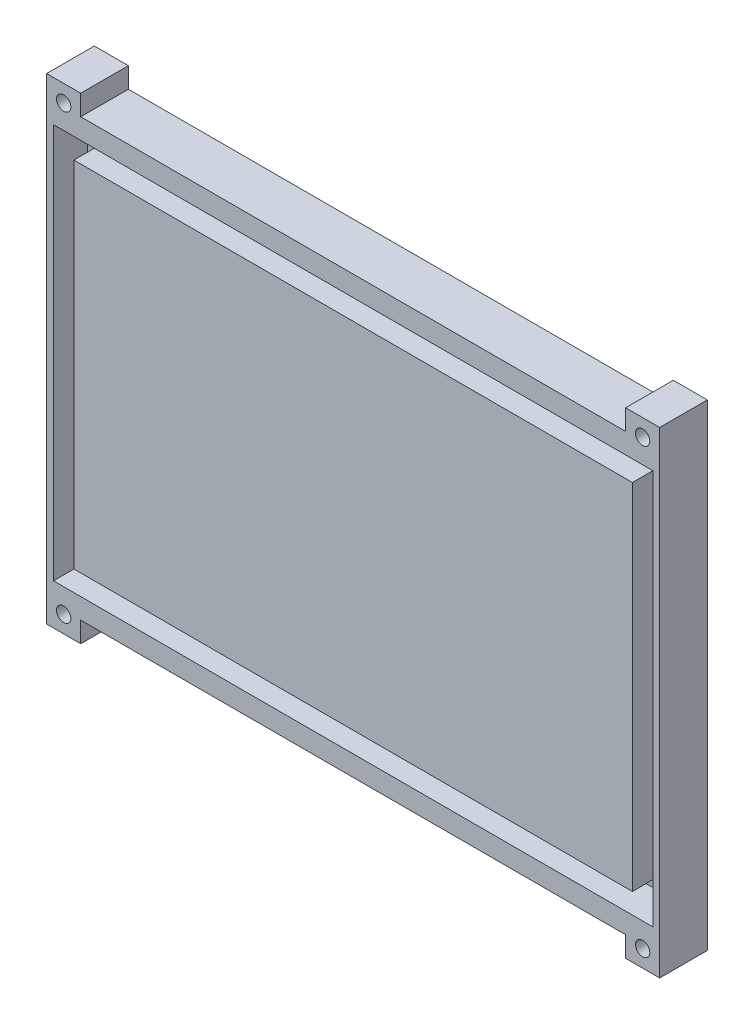
ISO-10303-21;
HEADER;
FILE_DESCRIPTION(('STEP AP214'),'2;1');
FILE_NAME('part.step','',(''),(''),'','','');
FILE_SCHEMA(('AUTOMOTIVE_DESIGN { 1 0 10303 214 1 1 1 1 }'));
ENDSEC;
DATA;
#1=APPLICATION_CONTEXT('core data for automotive mechanical design processes');
#2=APPLICATION_PROTOCOL_DEFINITION('international standard','automotive_design',2000,#1);
#3=PRODUCT_CONTEXT('',#1,'mechanical');
#4=PRODUCT('Part','Part','',(#3));
#5=PRODUCT_RELATED_PRODUCT_CATEGORY('part','',(#4));
#6=PRODUCT_DEFINITION_FORMATION('','',#4);
#7=PRODUCT_DEFINITION_CONTEXT('part definition',#1,'design');
#8=PRODUCT_DEFINITION('design','',#6,#7);
#9=PRODUCT_DEFINITION_SHAPE('','',#8);
#10=(LENGTH_UNIT() NAMED_UNIT(*) SI_UNIT(.MILLI.,.METRE.));
#11=(NAMED_UNIT(*) PLANE_ANGLE_UNIT() SI_UNIT($,.RADIAN.));
#12=(NAMED_UNIT(*) SI_UNIT($,.STERADIAN.) SOLID_ANGLE_UNIT());
#13=UNCERTAINTY_MEASURE_WITH_UNIT(LENGTH_MEASURE(1.E-05),#10,'distance_accuracy_value','');
#14=(GEOMETRIC_REPRESENTATION_CONTEXT(3) GLOBAL_UNCERTAINTY_ASSIGNED_CONTEXT((#13)) GLOBAL_UNIT_ASSIGNED_CONTEXT((#10,
#11,#12)) REPRESENTATION_CONTEXT('',''));
#15=CARTESIAN_POINT('',(0.,0.,0.));
#16=DIRECTION('',(0.,0.,1.));
#17=DIRECTION('',(1.,0.,0.));
#18=AXIS2_PLACEMENT_3D('',#15,#16,#17);
#19=CARTESIAN_POINT('',(-89.0867155495886,42.9813664596273,10.));
#20=DIRECTION('',(0.,1.,0.));
#21=DIRECTION('',(0.,0.,1.));
#22=AXIS2_PLACEMENT_3D('',#19,#20,#21);
#23=PLANE('',#22);
#24=DIRECTION('',(0.,0.,1.));
#25=VECTOR('',#24,1.);
#26=CARTESIAN_POINT('',(-79.0867155495886,42.9813664596273,0.));
#27=LINE('',#26,#25);
#28=CARTESIAN_POINT('',(-79.0867155495886,42.9813664596273,3.));
#29=VERTEX_POINT('',#28);
#30=CARTESIAN_POINT('',(-79.0867155495886,42.9813664596273,10.));
#31=VERTEX_POINT('',#30);
#32=EDGE_CURVE('E192',#29,#31,#27,.T.);
#33=ORIENTED_EDGE('',*,*,#32,.F.);
#34=DIRECTION('',(1.,0.,0.));
#35=VECTOR('',#34,1.);
#36=CARTESIAN_POINT('',(-84.0867155495887,42.9813664596273,3.));
#37=LINE('',#36,#35);
#38=CARTESIAN_POINT('',(-84.0867155495886,42.9813664596273,3.));
#39=VERTEX_POINT('',#38);
#40=EDGE_CURVE('E371',#39,#29,#37,.T.);
#41=ORIENTED_EDGE('',*,*,#40,.F.);
#42=DIRECTION('',(0.,0.,-1.));
#43=VECTOR('',#42,1.);
#44=CARTESIAN_POINT('',(-84.0867155495886,42.9813664596273,3.));
#45=LINE('',#44,#43);
#46=CARTESIAN_POINT('',(-84.0867155495886,42.9813664596273,10.));
#47=VERTEX_POINT('',#46);
#48=EDGE_CURVE('E352',#47,#39,#45,.T.);
#49=ORIENTED_EDGE('',*,*,#48,.F.);
#50=DIRECTION('',(1.,0.,0.));
#51=VECTOR('',#50,1.);
#52=CARTESIAN_POINT('',(-89.0867155495886,42.9813664596273,10.));
#53=LINE('',#52,#51);
#54=EDGE_CURVE('E382',#47,#31,#53,.T.);
#55=ORIENTED_EDGE('',*,*,#54,.T.);
#56=EDGE_LOOP('',(#33,#41,#49,#55));
#57=FACE_BOUND('',#56,.T.);
#58=ADVANCED_FACE('F40',(#57),#23,.T.);
#59=CARTESIAN_POINT('',(-89.0867155495886,-27.0186335403727,10.));
#60=DIRECTION('',(0.,1.,0.));
#61=DIRECTION('',(0.,0.,1.));
#62=AXIS2_PLACEMENT_3D('',#59,#60,#61);
#63=PLANE('',#62);
#64=DIRECTION('',(-1.,0.,0.));
#65=VECTOR('',#64,1.);
#66=CARTESIAN_POINT('',(5.91328445041138,-27.0186335403727,3.));
#67=LINE('',#66,#65);
#68=CARTESIAN_POINT('',(-79.0867155495886,-27.0186335403727,3.));
#69=VERTEX_POINT('',#68);
#70=CARTESIAN_POINT('',(-84.0867155495886,-27.0186335403727,3.00000000000001));
#71=VERTEX_POINT('',#70);
#72=EDGE_CURVE('E381',#69,#71,#67,.T.);
#73=ORIENTED_EDGE('',*,*,#72,.F.);
#74=DIRECTION('',(0.,0.,1.));
#75=VECTOR('',#74,1.);
#76=CARTESIAN_POINT('',(-79.0867155495886,-27.0186335403727,0.));
#77=LINE('',#76,#75);
#78=CARTESIAN_POINT('',(-79.0867155495886,-27.0186335403727,10.));
#79=VERTEX_POINT('',#78);
#80=EDGE_CURVE('E225',#69,#79,#77,.T.);
#81=ORIENTED_EDGE('',*,*,#80,.T.);
#82=DIRECTION('',(1.,0.,0.));
#83=VECTOR('',#82,1.);
#84=CARTESIAN_POINT('',(-89.0867155495886,-27.0186335403727,10.));
#85=LINE('',#84,#83);
#86=CARTESIAN_POINT('',(-84.0867155495886,-27.0186335403727,10.));
#87=VERTEX_POINT('',#86);
#88=EDGE_CURVE('E386',#87,#79,#85,.T.);
#89=ORIENTED_EDGE('',*,*,#88,.F.);
#90=DIRECTION('',(0.,0.,1.));
#91=VECTOR('',#90,1.);
#92=CARTESIAN_POINT('',(-84.0867155495886,-27.0186335403727,3.00000000000001));
#93=LINE('',#92,#91);
#94=EDGE_CURVE('E344',#71,#87,#93,.T.);
#95=ORIENTED_EDGE('',*,*,#94,.F.);
#96=EDGE_LOOP('',(#73,#81,#89,#95));
#97=FACE_BOUND('',#96,.T.);
#98=ADVANCED_FACE('F440',(#97),#63,.F.);
#99=DIRECTION('',(0.,0.,1.));
#100=VECTOR('',#99,1.);
#101=CARTESIAN_POINT('',(0.913284450411375,42.9813664596273,0.));
#102=LINE('',#101,#100);
#103=CARTESIAN_POINT('',(0.913284450411375,42.9813664596273,3.));
#104=VERTEX_POINT('',#103);
#105=CARTESIAN_POINT('',(0.913284450411375,42.9813664596273,10.));
#106=VERTEX_POINT('',#105);
#107=EDGE_CURVE('E209',#104,#106,#102,.T.);
#108=ORIENTED_EDGE('',*,*,#107,.T.);
#109=CARTESIAN_POINT('',(5.91328445041137,42.9813664596273,10.));
#110=VERTEX_POINT('',#109);
#111=EDGE_CURVE('E375',#106,#110,#53,.T.);
#112=ORIENTED_EDGE('',*,*,#111,.T.);
#113=DIRECTION('',(0.,0.,1.));
#114=VECTOR('',#113,1.);
#115=CARTESIAN_POINT('',(5.91328445041136,42.9813664596273,3.));
#116=LINE('',#115,#114);
#117=CARTESIAN_POINT('',(5.91328445041136,42.9813664596273,3.));
#118=VERTEX_POINT('',#117);
#119=EDGE_CURVE('E359',#118,#110,#116,.T.);
#120=ORIENTED_EDGE('',*,*,#119,.F.);
#121=EDGE_CURVE('E376',#104,#118,#37,.T.);
#122=ORIENTED_EDGE('',*,*,#121,.F.);
#123=EDGE_LOOP('',(#108,#112,#120,#122));
#124=FACE_BOUND('',#123,.T.);
#125=ADVANCED_FACE('F42',(#124),#23,.T.);
#126=CARTESIAN_POINT('',(0.91328445041132,-27.0186335403727,10.));
#127=VERTEX_POINT('',#126);
#128=CARTESIAN_POINT('',(5.91328445041137,-27.0186335403727,10.));
#129=VERTEX_POINT('',#128);
#130=EDGE_CURVE('E385',#127,#129,#85,.T.);
#131=ORIENTED_EDGE('',*,*,#130,.F.);
#132=DIRECTION('',(0.,0.,1.));
#133=VECTOR('',#132,1.);
#134=CARTESIAN_POINT('',(0.91328445041132,-27.0186335403727,0.));
#135=LINE('',#134,#133);
#136=CARTESIAN_POINT('',(0.91328445041132,-27.0186335403727,3.));
#137=VERTEX_POINT('',#136);
#138=EDGE_CURVE('E230',#137,#127,#135,.T.);
#139=ORIENTED_EDGE('',*,*,#138,.F.);
#140=CARTESIAN_POINT('',(5.91328445041136,-27.0186335403727,3.));
#141=VERTEX_POINT('',#140);
#142=EDGE_CURVE('E377',#141,#137,#67,.T.);
#143=ORIENTED_EDGE('',*,*,#142,.F.);
#144=DIRECTION('',(0.,0.,-1.));
#145=VECTOR('',#144,1.);
#146=CARTESIAN_POINT('',(5.91328445041137,-27.0186335403727,2.99999999999999));
#147=LINE('',#146,#145);
#148=EDGE_CURVE('E367',#129,#141,#147,.T.);
#149=ORIENTED_EDGE('',*,*,#148,.F.);
#150=EDGE_LOOP('',(#131,#139,#143,#149));
#151=FACE_BOUND('',#150,.T.);
#152=ADVANCED_FACE('F448',(#151),#63,.F.);
#153=CARTESIAN_POINT('',(0.,0.,10.));
#154=DIRECTION('',(0.,0.,-1.));
#155=DIRECTION('',(-1.,0.,0.));
#156=AXIS2_PLACEMENT_3D('',#153,#154,#155);
#157=PLANE('',#156);
#158=DIRECTION('',(1.,0.,0.));
#159=VECTOR('',#158,1.);
#160=CARTESIAN_POINT('',(-79.0867155495886,39.9813664596273,10.));
#161=LINE('',#160,#159);
#162=CARTESIAN_POINT('',(-79.0867155495886,39.9813664596273,10.));
#163=VERTEX_POINT('',#162);
#164=CARTESIAN_POINT('',(0.913284450411375,39.9813664596273,10.));
#165=VERTEX_POINT('',#164);
#166=EDGE_CURVE('E180',#163,#165,#161,.T.);
#167=ORIENTED_EDGE('',*,*,#166,.F.);
#168=DIRECTION('',(0.,-1.,0.));
#169=VECTOR('',#168,1.);
#170=CARTESIAN_POINT('',(-79.0867155495886,42.9813664596273,10.));
#171=LINE('',#170,#169);
#172=EDGE_CURVE('E189',#31,#163,#171,.T.);
#173=ORIENTED_EDGE('',*,*,#172,.F.);
#174=ORIENTED_EDGE('',*,*,#54,.F.);
#175=DIRECTION('',(0.,1.,0.));
#176=VECTOR('',#175,1.);
#177=CARTESIAN_POINT('',(-84.0867155495886,42.9813664596273,10.));
#178=LINE('',#177,#176);
#179=EDGE_CURVE('E348',#87,#47,#178,.T.);
#180=ORIENTED_EDGE('',*,*,#179,.F.);
#181=ORIENTED_EDGE('',*,*,#88,.T.);
#182=DIRECTION('',(0.,-1.,0.));
#183=VECTOR('',#182,1.);
#184=CARTESIAN_POINT('',(-79.0867155495886,-27.0186335403727,10.));
#185=LINE('',#184,#183);
#186=CARTESIAN_POINT('',(-79.0867155495886,-24.0186335403727,10.));
#187=VERTEX_POINT('',#186);
#188=EDGE_CURVE('E215',#187,#79,#185,.T.);
#189=ORIENTED_EDGE('',*,*,#188,.F.);
#190=DIRECTION('',(-1.,0.,0.));
#191=VECTOR('',#190,1.);
#192=CARTESIAN_POINT('',(-79.0867155495886,-24.0186335403727,10.));
#193=LINE('',#192,#191);
#194=CARTESIAN_POINT('',(0.91328445041132,-24.0186335403727,10.));
#195=VERTEX_POINT('',#194);
#196=EDGE_CURVE('E221',#195,#187,#193,.T.);
#197=ORIENTED_EDGE('',*,*,#196,.F.);
#198=DIRECTION('',(0.,1.,0.));
#199=VECTOR('',#198,1.);
#200=CARTESIAN_POINT('',(0.91328445041132,-27.0186335403727,10.));
#201=LINE('',#200,#199);
#202=EDGE_CURVE('E218',#127,#195,#201,.T.);
#203=ORIENTED_EDGE('',*,*,#202,.F.);
#204=ORIENTED_EDGE('',*,*,#130,.T.);
#205=DIRECTION('',(0.,-1.,0.));
#206=VECTOR('',#205,1.);
#207=CARTESIAN_POINT('',(5.91328445041136,42.9813664596273,10.));
#208=LINE('',#207,#206);
#209=EDGE_CURVE('E363',#110,#129,#208,.T.);
#210=ORIENTED_EDGE('',*,*,#209,.F.);
#211=ORIENTED_EDGE('',*,*,#111,.F.);
#212=DIRECTION('',(0.,1.,0.));
#213=VECTOR('',#212,1.);
#214=CARTESIAN_POINT('',(0.913284450411375,42.9813664596273,10.));
#215=LINE('',#214,#213);
#216=EDGE_CURVE('E186',#165,#106,#215,.T.);
#217=ORIENTED_EDGE('',*,*,#216,.F.);
#218=EDGE_LOOP('',(#167,#173,#174,#180,#181,#189,#197,#203,#204,#210,#211,#217));
#219=FACE_BOUND('',#218,.T.);
#220=DIRECTION('',(0.,-1.,0.));
#221=VECTOR('',#220,1.);
#222=CARTESIAN_POINT('',(-83.0867155495886,36.9813664596273,10.));
#223=LINE('',#222,#221);
#224=CARTESIAN_POINT('',(-83.0867155495886,36.9813664596273,10.));
#225=VERTEX_POINT('',#224);
#226=CARTESIAN_POINT('',(-83.0867155495886,-21.0186335403727,10.));
#227=VERTEX_POINT('',#226);
#228=EDGE_CURVE('E317',#225,#227,#223,.T.);
#229=ORIENTED_EDGE('',*,*,#228,.F.);
#230=DIRECTION('',(-1.,0.,0.));
#231=VECTOR('',#230,1.);
#232=CARTESIAN_POINT('',(-83.0867155495886,36.9813664596273,10.));
#233=LINE('',#232,#231);
#234=CARTESIAN_POINT('',(4.91328445041138,36.9813664596273,10.));
#235=VERTEX_POINT('',#234);
#236=EDGE_CURVE('E287',#235,#225,#233,.T.);
#237=ORIENTED_EDGE('',*,*,#236,.F.);
#238=DIRECTION('',(0.,1.,0.));
#239=VECTOR('',#238,1.);
#240=CARTESIAN_POINT('',(4.91328445041138,36.9813664596273,10.));
#241=LINE('',#240,#239);
#242=CARTESIAN_POINT('',(4.91328445041138,-21.0186335403727,10.));
#243=VERTEX_POINT('',#242);
#244=EDGE_CURVE('E302',#243,#235,#241,.T.);
#245=ORIENTED_EDGE('',*,*,#244,.F.);
#246=DIRECTION('',(1.,0.,0.));
#247=VECTOR('',#246,1.);
#248=CARTESIAN_POINT('',(-83.0867155495886,-21.0186335403727,10.));
#249=LINE('',#248,#247);
#250=EDGE_CURVE('E321',#227,#243,#249,.T.);
#251=ORIENTED_EDGE('',*,*,#250,.F.);
#252=EDGE_LOOP('',(#229,#237,#245,#251));
#253=FACE_BOUND('',#252,.T.);
#254=CARTESIAN_POINT('',(-81.5867155495887,40.4813664596273,10.));
#255=DIRECTION('',(0.,0.,1.));
#256=DIRECTION('',(1.,0.,0.));
#257=AXIS2_PLACEMENT_3D('',#254,#255,#256);
#258=CIRCLE('',#257,1.04999999999999);
#259=CARTESIAN_POINT('',(-80.5367155495887,40.4813664596273,10.));
#260=VERTEX_POINT('',#259);
#261=EDGE_CURVE('E247',#260,#260,#258,.T.);
#262=ORIENTED_EDGE('',*,*,#261,.F.);
#263=EDGE_LOOP('',(#262));
#264=FACE_BOUND('',#263,.T.);
#265=CARTESIAN_POINT('',(3.41328445041142,40.4813664596273,10.));
#266=DIRECTION('',(0.,0.,1.));
#267=DIRECTION('',(-1.,0.,0.));
#268=AXIS2_PLACEMENT_3D('',#265,#266,#267);
#269=CIRCLE('',#268,1.04999999999999);
#270=CARTESIAN_POINT('',(2.36328445041143,40.4813664596273,10.));
#271=VERTEX_POINT('',#270);
#272=EDGE_CURVE('E243',#271,#271,#269,.T.);
#273=ORIENTED_EDGE('',*,*,#272,.F.);
#274=EDGE_LOOP('',(#273));
#275=FACE_BOUND('',#274,.T.);
#276=CARTESIAN_POINT('',(3.41328445041142,-24.5186335403727,10.));
#277=DIRECTION('',(0.,0.,1.));
#278=DIRECTION('',(1.,0.,0.));
#279=AXIS2_PLACEMENT_3D('',#276,#277,#278);
#280=CIRCLE('',#279,1.04999999999999);
#281=CARTESIAN_POINT('',(4.46328445041141,-24.5186335403727,10.));
#282=VERTEX_POINT('',#281);
#283=EDGE_CURVE('E239',#282,#282,#280,.T.);
#284=ORIENTED_EDGE('',*,*,#283,.F.);
#285=EDGE_LOOP('',(#284));
#286=FACE_BOUND('',#285,.T.);
#287=CARTESIAN_POINT('',(-81.5867155495887,-24.5186335403727,10.));
#288=DIRECTION('',(0.,0.,1.));
#289=DIRECTION('',(-1.,0.,0.));
#290=AXIS2_PLACEMENT_3D('',#287,#288,#289);
#291=CIRCLE('',#290,1.04999999999999);
#292=CARTESIAN_POINT('',(-82.6367155495887,-24.5186335403727,10.));
#293=VERTEX_POINT('',#292);
#294=EDGE_CURVE('E208',#293,#293,#291,.T.);
#295=ORIENTED_EDGE('',*,*,#294,.F.);
#296=EDGE_LOOP('',(#295));
#297=FACE_BOUND('',#296,.T.);
#298=ADVANCED_FACE('F198',(#219,#253,#264,#275,#286,#297),#157,.F.);
#299=CARTESIAN_POINT('',(0.,0.,3.));
#300=DIRECTION('',(0.,0.,1.));
#301=DIRECTION('',(1.,0.,0.));
#302=AXIS2_PLACEMENT_3D('',#299,#300,#301);
#303=PLANE('',#302);
#304=ORIENTED_EDGE('',*,*,#40,.T.);
#305=DIRECTION('',(0.,-1.,0.));
#306=VECTOR('',#305,1.);
#307=CARTESIAN_POINT('',(-79.0867155495886,0.,3.));
#308=LINE('',#307,#306);
#309=CARTESIAN_POINT('',(-79.0867155495886,39.9813664596273,3.));
#310=VERTEX_POINT('',#309);
#311=EDGE_CURVE('E11',#29,#310,#308,.T.);
#312=ORIENTED_EDGE('',*,*,#311,.T.);
#313=DIRECTION('',(1.,0.,0.));
#314=VECTOR('',#313,1.);
#315=CARTESIAN_POINT('',(0.,39.9813664596273,3.));
#316=LINE('',#315,#314);
#317=CARTESIAN_POINT('',(0.913284450411375,39.9813664596273,3.));
#318=VERTEX_POINT('',#317);
#319=EDGE_CURVE('E183',#310,#318,#316,.T.);
#320=ORIENTED_EDGE('',*,*,#319,.T.);
#321=DIRECTION('',(0.,1.,0.));
#322=VECTOR('',#321,1.);
#323=CARTESIAN_POINT('',(0.913284450411375,0.,3.));
#324=LINE('',#323,#322);
#325=EDGE_CURVE('E49',#318,#104,#324,.T.);
#326=ORIENTED_EDGE('',*,*,#325,.T.);
#327=ORIENTED_EDGE('',*,*,#121,.T.);
#328=DIRECTION('',(0.,1.,0.));
#329=VECTOR('',#328,1.);
#330=CARTESIAN_POINT('',(5.91328445041136,42.9813664596273,3.));
#331=LINE('',#330,#329);
#332=EDGE_CURVE('E355',#141,#118,#331,.T.);
#333=ORIENTED_EDGE('',*,*,#332,.F.);
#334=ORIENTED_EDGE('',*,*,#142,.T.);
#335=DIRECTION('',(0.,1.,0.));
#336=VECTOR('',#335,1.);
#337=CARTESIAN_POINT('',(0.91328445041132,0.,3.));
#338=LINE('',#337,#336);
#339=CARTESIAN_POINT('',(0.91328445041132,-24.0186335403727,3.));
#340=VERTEX_POINT('',#339);
#341=EDGE_CURVE('E390',#137,#340,#338,.T.);
#342=ORIENTED_EDGE('',*,*,#341,.T.);
#343=DIRECTION('',(-1.,0.,0.));
#344=VECTOR('',#343,1.);
#345=CARTESIAN_POINT('',(0.,-24.0186335403727,3.));
#346=LINE('',#345,#344);
#347=CARTESIAN_POINT('',(-79.0867155495886,-24.0186335403727,3.));
#348=VERTEX_POINT('',#347);
#349=EDGE_CURVE('E409',#340,#348,#346,.T.);
#350=ORIENTED_EDGE('',*,*,#349,.T.);
#351=DIRECTION('',(0.,-1.,0.));
#352=VECTOR('',#351,1.);
#353=CARTESIAN_POINT('',(-79.0867155495886,0.,3.));
#354=LINE('',#353,#352);
#355=EDGE_CURVE('E413',#348,#69,#354,.T.);
#356=ORIENTED_EDGE('',*,*,#355,.T.);
#357=ORIENTED_EDGE('',*,*,#72,.T.);
#358=DIRECTION('',(0.,-1.,0.));
#359=VECTOR('',#358,1.);
#360=CARTESIAN_POINT('',(-84.0867155495886,42.9813664596273,3.));
#361=LINE('',#360,#359);
#362=EDGE_CURVE('E331',#39,#71,#361,.T.);
#363=ORIENTED_EDGE('',*,*,#362,.F.);
#364=EDGE_LOOP('',(#304,#312,#320,#326,#327,#333,#334,#342,#350,#356,#357,#363));
#365=FACE_BOUND('',#364,.T.);
#366=CARTESIAN_POINT('',(3.41328445041138,40.4813664596273,3.));
#367=DIRECTION('',(0.,0.,-1.));
#368=DIRECTION('',(-1.,0.,0.));
#369=AXIS2_PLACEMENT_3D('',#366,#367,#368);
#370=CIRCLE('',#369,1.05);
#371=CARTESIAN_POINT('',(2.36328445041138,40.4813664596273,3.));
#372=VERTEX_POINT('',#371);
#373=EDGE_CURVE('E402',#372,#372,#370,.T.);
#374=ORIENTED_EDGE('',*,*,#373,.F.);
#375=EDGE_LOOP('',(#374));
#376=FACE_BOUND('',#375,.T.);
#377=CARTESIAN_POINT('',(-81.5867155495887,40.4813664596273,3.));
#378=DIRECTION('',(0.,0.,1.));
#379=DIRECTION('',(1.,0.,0.));
#380=AXIS2_PLACEMENT_3D('',#377,#378,#379);
#381=CIRCLE('',#380,1.04999999999999);
#382=CARTESIAN_POINT('',(-80.5367155495887,40.4813664596273,3.));
#383=VERTEX_POINT('',#382);
#384=EDGE_CURVE('E398',#383,#383,#381,.T.);
#385=ORIENTED_EDGE('',*,*,#384,.T.);
#386=EDGE_LOOP('',(#385));
#387=FACE_BOUND('',#386,.T.);
#388=CARTESIAN_POINT('',(-81.5867155495886,-24.5186335403727,3.));
#389=DIRECTION('',(0.,0.,1.));
#390=DIRECTION('',(1.,0.,0.));
#391=AXIS2_PLACEMENT_3D('',#388,#389,#390);
#392=CIRCLE('',#391,1.04999999999999);
#393=CARTESIAN_POINT('',(-80.5367155495886,-24.5186335403727,3.));
#394=VERTEX_POINT('',#393);
#395=EDGE_CURVE('E394',#394,#394,#392,.T.);
#396=ORIENTED_EDGE('',*,*,#395,.T.);
#397=EDGE_LOOP('',(#396));
#398=FACE_BOUND('',#397,.T.);
#399=CARTESIAN_POINT('',(3.41328445041136,-24.5186335403727,3.));
#400=DIRECTION('',(0.,0.,1.));
#401=DIRECTION('',(1.,0.,0.));
#402=AXIS2_PLACEMENT_3D('',#399,#400,#401);
#403=CIRCLE('',#402,1.05);
#404=CARTESIAN_POINT('',(4.46328445041136,-24.5186335403727,3.));
#405=VERTEX_POINT('',#404);
#406=EDGE_CURVE('E370',#405,#405,#403,.T.);
#407=ORIENTED_EDGE('',*,*,#406,.T.);
#408=EDGE_LOOP('',(#407));
#409=FACE_BOUND('',#408,.T.);
#410=ADVANCED_FACE('F422',(#365,#376,#387,#398,#409),#303,.F.);
#411=CARTESIAN_POINT('',(3.41328445041136,-24.5186335403727,42.));
#412=DIRECTION('',(0.,0.,-1.));
#413=DIRECTION('',(-1.,0.,0.));
#414=AXIS2_PLACEMENT_3D('',#411,#412,#413);
#415=CYLINDRICAL_SURFACE('',#414,1.05);
#416=ORIENTED_EDGE('',*,*,#406,.F.);
#417=EDGE_LOOP('',(#416));
#418=FACE_BOUND('',#417,.T.);
#419=ORIENTED_EDGE('',*,*,#283,.T.);
#420=EDGE_LOOP('',(#419));
#421=FACE_BOUND('',#420,.T.);
#422=ADVANCED_FACE('F463',(#418,#421),#415,.F.);
#423=CARTESIAN_POINT('',(-81.5867155495886,-24.5186335403727,42.));
#424=DIRECTION('',(0.,0.,-1.));
#425=DIRECTION('',(-1.,0.,0.));
#426=AXIS2_PLACEMENT_3D('',#423,#424,#425);
#427=CYLINDRICAL_SURFACE('',#426,1.04999999999999);
#428=ORIENTED_EDGE('',*,*,#395,.F.);
#429=EDGE_LOOP('',(#428));
#430=FACE_BOUND('',#429,.T.);
#431=ORIENTED_EDGE('',*,*,#294,.T.);
#432=EDGE_LOOP('',(#431));
#433=FACE_BOUND('',#432,.T.);
#434=ADVANCED_FACE('F472',(#430,#433),#427,.F.);
#435=CARTESIAN_POINT('',(-81.5867155495887,40.4813664596273,42.));
#436=DIRECTION('',(0.,0.,-1.));
#437=DIRECTION('',(-1.,0.,0.));
#438=AXIS2_PLACEMENT_3D('',#435,#436,#437);
#439=CYLINDRICAL_SURFACE('',#438,1.04999999999999);
#440=ORIENTED_EDGE('',*,*,#384,.F.);
#441=EDGE_LOOP('',(#440));
#442=FACE_BOUND('',#441,.T.);
#443=ORIENTED_EDGE('',*,*,#261,.T.);
#444=EDGE_LOOP('',(#443));
#445=FACE_BOUND('',#444,.T.);
#446=ADVANCED_FACE('F468',(#442,#445),#439,.F.);
#447=CARTESIAN_POINT('',(3.41328445041138,40.4813664596273,42.));
#448=DIRECTION('',(0.,0.,-1.));
#449=DIRECTION('',(-1.,0.,0.));
#450=AXIS2_PLACEMENT_3D('',#447,#448,#449);
#451=CYLINDRICAL_SURFACE('',#450,1.05);
#452=ORIENTED_EDGE('',*,*,#373,.T.);
#453=EDGE_LOOP('',(#452));
#454=FACE_BOUND('',#453,.T.);
#455=ORIENTED_EDGE('',*,*,#272,.T.);
#456=EDGE_LOOP('',(#455));
#457=FACE_BOUND('',#456,.T.);
#458=ADVANCED_FACE('F464',(#454,#457),#451,.F.);
#459=CARTESIAN_POINT('',(5.91328445041137,0.,0.));
#460=DIRECTION('',(-1.,0.,0.));
#461=DIRECTION('',(0.,-1.,0.));
#462=AXIS2_PLACEMENT_3D('',#459,#460,#461);
#463=PLANE('',#462);
#464=ORIENTED_EDGE('',*,*,#119,.T.);
#465=ORIENTED_EDGE('',*,*,#209,.T.);
#466=ORIENTED_EDGE('',*,*,#148,.T.);
#467=ORIENTED_EDGE('',*,*,#332,.T.);
#468=EDGE_LOOP('',(#464,#465,#466,#467));
#469=FACE_BOUND('',#468,.T.);
#470=ADVANCED_FACE('F467',(#469),#463,.F.);
#471=CARTESIAN_POINT('',(-84.0867155495886,0.,0.));
#472=DIRECTION('',(-1.,0.,0.));
#473=DIRECTION('',(0.,0.,1.));
#474=AXIS2_PLACEMENT_3D('',#471,#472,#473);
#475=PLANE('',#474);
#476=ORIENTED_EDGE('',*,*,#94,.T.);
#477=ORIENTED_EDGE('',*,*,#179,.T.);
#478=ORIENTED_EDGE('',*,*,#48,.T.);
#479=ORIENTED_EDGE('',*,*,#362,.T.);
#480=EDGE_LOOP('',(#476,#477,#478,#479));
#481=FACE_BOUND('',#480,.T.);
#482=ADVANCED_FACE('F437',(#481),#475,.T.);
#483=CARTESIAN_POINT('',(-83.0867155495886,36.9813664596273,5.));
#484=DIRECTION('',(0.,1.,0.));
#485=DIRECTION('',(0.,0.,1.));
#486=AXIS2_PLACEMENT_3D('',#483,#484,#485);
#487=PLANE('',#486);
#488=ORIENTED_EDGE('',*,*,#236,.T.);
#489=DIRECTION('',(0.,0.,1.));
#490=VECTOR('',#489,1.);
#491=CARTESIAN_POINT('',(-83.0867155495886,36.9813664596273,5.));
#492=LINE('',#491,#490);
#493=CARTESIAN_POINT('',(-83.0867155495886,36.9813664596273,5.));
#494=VERTEX_POINT('',#493);
#495=EDGE_CURVE('E314',#494,#225,#492,.T.);
#496=ORIENTED_EDGE('',*,*,#495,.F.);
#497=DIRECTION('',(-1.,0.,0.));
#498=VECTOR('',#497,1.);
#499=CARTESIAN_POINT('',(-83.0867155495886,36.9813664596273,5.));
#500=LINE('',#499,#498);
#501=CARTESIAN_POINT('',(4.91328445041138,36.9813664596273,5.));
#502=VERTEX_POINT('',#501);
#503=EDGE_CURVE('E297',#502,#494,#500,.T.);
#504=ORIENTED_EDGE('',*,*,#503,.F.);
#505=DIRECTION('',(0.,0.,1.));
#506=VECTOR('',#505,1.);
#507=CARTESIAN_POINT('',(4.91328445041138,36.9813664596273,5.));
#508=LINE('',#507,#506);
#509=EDGE_CURVE('E328',#502,#235,#508,.T.);
#510=ORIENTED_EDGE('',*,*,#509,.T.);
#511=EDGE_LOOP('',(#488,#496,#504,#510));
#512=FACE_BOUND('',#511,.T.);
#513=ADVANCED_FACE('F485',(#512),#487,.F.);
#514=CARTESIAN_POINT('',(4.91328445041138,36.9813664596273,5.));
#515=DIRECTION('',(1.,0.,0.));
#516=DIRECTION('',(0.,0.,-1.));
#517=AXIS2_PLACEMENT_3D('',#514,#515,#516);
#518=PLANE('',#517);
#519=ORIENTED_EDGE('',*,*,#244,.T.);
#520=ORIENTED_EDGE('',*,*,#509,.F.);
#521=DIRECTION('',(0.,1.,0.));
#522=VECTOR('',#521,1.);
#523=CARTESIAN_POINT('',(4.91328445041138,36.9813664596273,5.));
#524=LINE('',#523,#522);
#525=CARTESIAN_POINT('',(4.91328445041138,-21.0186335403727,5.));
#526=VERTEX_POINT('',#525);
#527=EDGE_CURVE('E310',#526,#502,#524,.T.);
#528=ORIENTED_EDGE('',*,*,#527,.F.);
#529=DIRECTION('',(0.,0.,1.));
#530=VECTOR('',#529,1.);
#531=CARTESIAN_POINT('',(4.91328445041138,-21.0186335403727,5.));
#532=LINE('',#531,#530);
#533=EDGE_CURVE('E332',#526,#243,#532,.T.);
#534=ORIENTED_EDGE('',*,*,#533,.T.);
#535=EDGE_LOOP('',(#519,#520,#528,#534));
#536=FACE_BOUND('',#535,.T.);
#537=ADVANCED_FACE('F488',(#536),#518,.F.);
#538=CARTESIAN_POINT('',(-83.0867155495886,-21.0186335403727,5.));
#539=DIRECTION('',(0.,-1.,0.));
#540=DIRECTION('',(0.,0.,-1.));
#541=AXIS2_PLACEMENT_3D('',#538,#539,#540);
#542=PLANE('',#541);
#543=ORIENTED_EDGE('',*,*,#250,.T.);
#544=ORIENTED_EDGE('',*,*,#533,.F.);
#545=DIRECTION('',(1.,0.,0.));
#546=VECTOR('',#545,1.);
#547=CARTESIAN_POINT('',(-83.0867155495886,-21.0186335403727,5.));
#548=LINE('',#547,#546);
#549=CARTESIAN_POINT('',(-83.0867155495886,-21.0186335403727,5.));
#550=VERTEX_POINT('',#549);
#551=EDGE_CURVE('E306',#550,#526,#548,.T.);
#552=ORIENTED_EDGE('',*,*,#551,.F.);
#553=DIRECTION('',(0.,0.,1.));
#554=VECTOR('',#553,1.);
#555=CARTESIAN_POINT('',(-83.0867155495886,-21.0186335403727,5.));
#556=LINE('',#555,#554);
#557=EDGE_CURVE('E335',#550,#227,#556,.T.);
#558=ORIENTED_EDGE('',*,*,#557,.T.);
#559=EDGE_LOOP('',(#543,#544,#552,#558));
#560=FACE_BOUND('',#559,.T.);
#561=ADVANCED_FACE('F494',(#560),#542,.F.);
#562=CARTESIAN_POINT('',(-83.0867155495886,36.9813664596273,5.));
#563=DIRECTION('',(-1.,0.,0.));
#564=DIRECTION('',(0.,0.,1.));
#565=AXIS2_PLACEMENT_3D('',#562,#563,#564);
#566=PLANE('',#565);
#567=ORIENTED_EDGE('',*,*,#228,.T.);
#568=ORIENTED_EDGE('',*,*,#557,.F.);
#569=DIRECTION('',(0.,-1.,0.));
#570=VECTOR('',#569,1.);
#571=CARTESIAN_POINT('',(-83.0867155495886,36.9813664596273,5.));
#572=LINE('',#571,#570);
#573=EDGE_CURVE('E301',#494,#550,#572,.T.);
#574=ORIENTED_EDGE('',*,*,#573,.F.);
#575=ORIENTED_EDGE('',*,*,#495,.T.);
#576=EDGE_LOOP('',(#567,#568,#574,#575));
#577=FACE_BOUND('',#576,.T.);
#578=ADVANCED_FACE('F490',(#577),#566,.F.);
#579=CARTESIAN_POINT('',(0.,0.,5.));
#580=DIRECTION('',(0.,0.,-1.));
#581=DIRECTION('',(-1.,0.,0.));
#582=AXIS2_PLACEMENT_3D('',#579,#580,#581);
#583=PLANE('',#582);
#584=DIRECTION('',(1.,0.,0.));
#585=VECTOR('',#584,1.);
#586=CARTESIAN_POINT('',(-80.0867155495886,-18.0186335403727,5.));
#587=LINE('',#586,#585);
#588=CARTESIAN_POINT('',(-80.0867155495886,-18.0186335403727,5.));
#589=VERTEX_POINT('',#588);
#590=CARTESIAN_POINT('',(1.91328445041137,-18.0186335403727,5.));
#591=VERTEX_POINT('',#590);
#592=EDGE_CURVE('E252',#589,#591,#587,.T.);
#593=ORIENTED_EDGE('',*,*,#592,.F.);
#594=DIRECTION('',(0.,-1.,0.));
#595=VECTOR('',#594,1.);
#596=CARTESIAN_POINT('',(-80.0867155495886,33.9813664596273,5.));
#597=LINE('',#596,#595);
#598=CARTESIAN_POINT('',(-80.0867155495886,33.9813664596273,5.));
#599=VERTEX_POINT('',#598);
#600=EDGE_CURVE('E265',#599,#589,#597,.T.);
#601=ORIENTED_EDGE('',*,*,#600,.F.);
#602=DIRECTION('',(-1.,0.,0.));
#603=VECTOR('',#602,1.);
#604=CARTESIAN_POINT('',(-80.0867155495886,33.9813664596273,5.));
#605=LINE('',#604,#603);
#606=CARTESIAN_POINT('',(1.91328445041137,33.9813664596273,5.));
#607=VERTEX_POINT('',#606);
#608=EDGE_CURVE('E261',#607,#599,#605,.T.);
#609=ORIENTED_EDGE('',*,*,#608,.F.);
#610=DIRECTION('',(0.,1.,0.));
#611=VECTOR('',#610,1.);
#612=CARTESIAN_POINT('',(1.91328445041137,33.9813664596273,5.));
#613=LINE('',#612,#611);
#614=EDGE_CURVE('E256',#591,#607,#613,.T.);
#615=ORIENTED_EDGE('',*,*,#614,.F.);
#616=EDGE_LOOP('',(#593,#601,#609,#615));
#617=FACE_BOUND('',#616,.T.);
#618=ORIENTED_EDGE('',*,*,#503,.T.);
#619=ORIENTED_EDGE('',*,*,#573,.T.);
#620=ORIENTED_EDGE('',*,*,#551,.T.);
#621=ORIENTED_EDGE('',*,*,#527,.T.);
#622=EDGE_LOOP('',(#618,#619,#620,#621));
#623=FACE_BOUND('',#622,.T.);
#624=ADVANCED_FACE('F493',(#617,#623),#583,.F.);
#625=CARTESIAN_POINT('',(-80.0867155495886,-18.0186335403727,5.));
#626=DIRECTION('',(0.,-1.,0.));
#627=DIRECTION('',(0.,0.,-1.));
#628=AXIS2_PLACEMENT_3D('',#625,#626,#627);
#629=PLANE('',#628);
#630=DIRECTION('',(1.,0.,0.));
#631=VECTOR('',#630,1.);
#632=CARTESIAN_POINT('',(-80.0867155495886,-18.0186335403727,10.));
#633=LINE('',#632,#631);
#634=CARTESIAN_POINT('',(-80.0867155495886,-18.0186335403727,10.));
#635=VERTEX_POINT('',#634);
#636=CARTESIAN_POINT('',(1.91328445041137,-18.0186335403727,10.));
#637=VERTEX_POINT('',#636);
#638=EDGE_CURVE('E251',#635,#637,#633,.T.);
#639=ORIENTED_EDGE('',*,*,#638,.F.);
#640=DIRECTION('',(0.,0.,1.));
#641=VECTOR('',#640,1.);
#642=CARTESIAN_POINT('',(-80.0867155495886,-18.0186335403727,5.));
#643=LINE('',#642,#641);
#644=EDGE_CURVE('E284',#589,#635,#643,.T.);
#645=ORIENTED_EDGE('',*,*,#644,.F.);
#646=ORIENTED_EDGE('',*,*,#592,.T.);
#647=DIRECTION('',(0.,0.,1.));
#648=VECTOR('',#647,1.);
#649=CARTESIAN_POINT('',(1.91328445041137,-18.0186335403727,5.));
#650=LINE('',#649,#648);
#651=EDGE_CURVE('E269',#591,#637,#650,.T.);
#652=ORIENTED_EDGE('',*,*,#651,.T.);
#653=EDGE_LOOP('',(#639,#645,#646,#652));
#654=FACE_BOUND('',#653,.T.);
#655=ADVANCED_FACE('F504',(#654),#629,.T.);
#656=CARTESIAN_POINT('',(-80.0867155495886,33.9813664596273,5.));
#657=DIRECTION('',(-1.,0.,0.));
#658=DIRECTION('',(0.,0.,1.));
#659=AXIS2_PLACEMENT_3D('',#656,#657,#658);
#660=PLANE('',#659);
#661=DIRECTION('',(0.,-1.,0.));
#662=VECTOR('',#661,1.);
#663=CARTESIAN_POINT('',(-80.0867155495886,33.9813664596273,10.));
#664=LINE('',#663,#662);
#665=CARTESIAN_POINT('',(-80.0867155495886,33.9813664596273,10.));
#666=VERTEX_POINT('',#665);
#667=EDGE_CURVE('E257',#666,#635,#664,.T.);
#668=ORIENTED_EDGE('',*,*,#667,.F.);
#669=DIRECTION('',(0.,0.,1.));
#670=VECTOR('',#669,1.);
#671=CARTESIAN_POINT('',(-80.0867155495886,33.9813664596273,5.));
#672=LINE('',#671,#670);
#673=EDGE_CURVE('E288',#599,#666,#672,.T.);
#674=ORIENTED_EDGE('',*,*,#673,.F.);
#675=ORIENTED_EDGE('',*,*,#600,.T.);
#676=ORIENTED_EDGE('',*,*,#644,.T.);
#677=EDGE_LOOP('',(#668,#674,#675,#676));
#678=FACE_BOUND('',#677,.T.);
#679=ADVANCED_FACE('F508',(#678),#660,.T.);
#680=CARTESIAN_POINT('',(-80.0867155495886,33.9813664596273,5.));
#681=DIRECTION('',(0.,1.,0.));
#682=DIRECTION('',(0.,0.,1.));
#683=AXIS2_PLACEMENT_3D('',#680,#681,#682);
#684=PLANE('',#683);
#685=DIRECTION('',(-1.,0.,0.));
#686=VECTOR('',#685,1.);
#687=CARTESIAN_POINT('',(-80.0867155495886,33.9813664596273,10.));
#688=LINE('',#687,#686);
#689=CARTESIAN_POINT('',(1.91328445041137,33.9813664596273,10.));
#690=VERTEX_POINT('',#689);
#691=EDGE_CURVE('E277',#690,#666,#688,.T.);
#692=ORIENTED_EDGE('',*,*,#691,.F.);
#693=DIRECTION('',(0.,0.,1.));
#694=VECTOR('',#693,1.);
#695=CARTESIAN_POINT('',(1.91328445041137,33.9813664596273,5.));
#696=LINE('',#695,#694);
#697=EDGE_CURVE('E291',#607,#690,#696,.T.);
#698=ORIENTED_EDGE('',*,*,#697,.F.);
#699=ORIENTED_EDGE('',*,*,#608,.T.);
#700=ORIENTED_EDGE('',*,*,#673,.T.);
#701=EDGE_LOOP('',(#692,#698,#699,#700));
#702=FACE_BOUND('',#701,.T.);
#703=ADVANCED_FACE('F513',(#702),#684,.T.);
#704=CARTESIAN_POINT('',(1.91328445041137,33.9813664596273,5.));
#705=DIRECTION('',(1.,0.,0.));
#706=DIRECTION('',(0.,0.,-1.));
#707=AXIS2_PLACEMENT_3D('',#704,#705,#706);
#708=PLANE('',#707);
#709=DIRECTION('',(0.,1.,0.));
#710=VECTOR('',#709,1.);
#711=CARTESIAN_POINT('',(1.91328445041137,33.9813664596273,10.));
#712=LINE('',#711,#710);
#713=EDGE_CURVE('E273',#637,#690,#712,.T.);
#714=ORIENTED_EDGE('',*,*,#713,.F.);
#715=ORIENTED_EDGE('',*,*,#651,.F.);
#716=ORIENTED_EDGE('',*,*,#614,.T.);
#717=ORIENTED_EDGE('',*,*,#697,.T.);
#718=EDGE_LOOP('',(#714,#715,#716,#717));
#719=FACE_BOUND('',#718,.T.);
#720=ADVANCED_FACE('F510',(#719),#708,.T.);
#721=ORIENTED_EDGE('',*,*,#638,.T.);
#722=ORIENTED_EDGE('',*,*,#713,.T.);
#723=ORIENTED_EDGE('',*,*,#691,.T.);
#724=ORIENTED_EDGE('',*,*,#667,.T.);
#725=EDGE_LOOP('',(#721,#722,#723,#724));
#726=FACE_BOUND('',#725,.T.);
#727=ADVANCED_FACE('F458',(#726),#157,.F.);
#728=CARTESIAN_POINT('',(-79.0867155495886,-27.0186335403727,0.));
#729=DIRECTION('',(-1.,0.,0.));
#730=DIRECTION('',(0.,0.,1.));
#731=AXIS2_PLACEMENT_3D('',#728,#729,#730);
#732=PLANE('',#731);
#733=DIRECTION('',(0.,0.,1.));
#734=VECTOR('',#733,1.);
#735=CARTESIAN_POINT('',(-79.0867155495886,-24.0186335403727,0.));
#736=LINE('',#735,#734);
#737=EDGE_CURVE('E196',#348,#187,#736,.T.);
#738=ORIENTED_EDGE('',*,*,#737,.T.);
#739=ORIENTED_EDGE('',*,*,#188,.T.);
#740=ORIENTED_EDGE('',*,*,#80,.F.);
#741=ORIENTED_EDGE('',*,*,#355,.F.);
#742=EDGE_LOOP('',(#738,#739,#740,#741));
#743=FACE_BOUND('',#742,.T.);
#744=ADVANCED_FACE('F521',(#743),#732,.F.);
#745=CARTESIAN_POINT('',(-79.0867155495886,-24.0186335403727,0.));
#746=DIRECTION('',(0.,1.,0.));
#747=DIRECTION('',(0.,0.,1.));
#748=AXIS2_PLACEMENT_3D('',#745,#746,#747);
#749=PLANE('',#748);
#750=DIRECTION('',(0.,0.,1.));
#751=VECTOR('',#750,1.);
#752=CARTESIAN_POINT('',(0.91328445041132,-24.0186335403727,0.));
#753=LINE('',#752,#751);
#754=EDGE_CURVE('E64',#340,#195,#753,.T.);
#755=ORIENTED_EDGE('',*,*,#754,.T.);
#756=ORIENTED_EDGE('',*,*,#196,.T.);
#757=ORIENTED_EDGE('',*,*,#737,.F.);
#758=ORIENTED_EDGE('',*,*,#349,.F.);
#759=EDGE_LOOP('',(#755,#756,#757,#758));
#760=FACE_BOUND('',#759,.T.);
#761=ADVANCED_FACE('F524',(#760),#749,.F.);
#762=CARTESIAN_POINT('',(0.91328445041132,-27.0186335403727,0.));
#763=DIRECTION('',(1.,0.,0.));
#764=DIRECTION('',(0.,0.,-1.));
#765=AXIS2_PLACEMENT_3D('',#762,#763,#764);
#766=PLANE('',#765);
#767=ORIENTED_EDGE('',*,*,#138,.T.);
#768=ORIENTED_EDGE('',*,*,#202,.T.);
#769=ORIENTED_EDGE('',*,*,#754,.F.);
#770=ORIENTED_EDGE('',*,*,#341,.F.);
#771=EDGE_LOOP('',(#767,#768,#769,#770));
#772=FACE_BOUND('',#771,.T.);
#773=ADVANCED_FACE('F526',(#772),#766,.F.);
#774=CARTESIAN_POINT('',(-79.0867155495886,42.9813664596273,0.));
#775=DIRECTION('',(-1.,0.,0.));
#776=DIRECTION('',(0.,0.,1.));
#777=AXIS2_PLACEMENT_3D('',#774,#775,#776);
#778=PLANE('',#777);
#779=ORIENTED_EDGE('',*,*,#32,.T.);
#780=ORIENTED_EDGE('',*,*,#172,.T.);
#781=DIRECTION('',(0.,0.,1.));
#782=VECTOR('',#781,1.);
#783=CARTESIAN_POINT('',(-79.0867155495886,39.9813664596273,0.));
#784=LINE('',#783,#782);
#785=EDGE_CURVE('E176',#310,#163,#784,.T.);
#786=ORIENTED_EDGE('',*,*,#785,.F.);
#787=ORIENTED_EDGE('',*,*,#311,.F.);
#788=EDGE_LOOP('',(#779,#780,#786,#787));
#789=FACE_BOUND('',#788,.T.);
#790=ADVANCED_FACE('F190',(#789),#778,.F.);
#791=CARTESIAN_POINT('',(0.913284450411375,42.9813664596273,0.));
#792=DIRECTION('',(1.,0.,0.));
#793=DIRECTION('',(0.,0.,-1.));
#794=AXIS2_PLACEMENT_3D('',#791,#792,#793);
#795=PLANE('',#794);
#796=DIRECTION('',(0.,0.,1.));
#797=VECTOR('',#796,1.);
#798=CARTESIAN_POINT('',(0.913284450411375,39.9813664596273,0.));
#799=LINE('',#798,#797);
#800=EDGE_CURVE('E56',#318,#165,#799,.T.);
#801=ORIENTED_EDGE('',*,*,#800,.T.);
#802=ORIENTED_EDGE('',*,*,#216,.T.);
#803=ORIENTED_EDGE('',*,*,#107,.F.);
#804=ORIENTED_EDGE('',*,*,#325,.F.);
#805=EDGE_LOOP('',(#801,#802,#803,#804));
#806=FACE_BOUND('',#805,.T.);
#807=ADVANCED_FACE('F534',(#806),#795,.F.);
#808=CARTESIAN_POINT('',(-79.0867155495886,39.9813664596273,0.));
#809=DIRECTION('',(0.,-1.,0.));
#810=DIRECTION('',(0.,0.,-1.));
#811=AXIS2_PLACEMENT_3D('',#808,#809,#810);
#812=PLANE('',#811);
#813=ORIENTED_EDGE('',*,*,#785,.T.);
#814=ORIENTED_EDGE('',*,*,#166,.T.);
#815=ORIENTED_EDGE('',*,*,#800,.F.);
#816=ORIENTED_EDGE('',*,*,#319,.F.);
#817=EDGE_LOOP('',(#813,#814,#815,#816));
#818=FACE_BOUND('',#817,.T.);
#819=ADVANCED_FACE('F178',(#818),#812,.F.);
#820=CLOSED_SHELL('',(#58,#98,#125,#152,#298,#410,#422,#434,#446,#458,#470,#482,#513,#537,#561,
#578,#624,#655,#679,#703,#720,#727,#744,#761,#773,#790,#807,#819));
#821=MANIFOLD_SOLID_BREP('B2',#820);
#822=ADVANCED_BREP_SHAPE_REPRESENTATION('',(#18,#821),#14);
#823=SHAPE_DEFINITION_REPRESENTATION(#9,#822);
ENDSEC;
END-ISO-10303-21;
